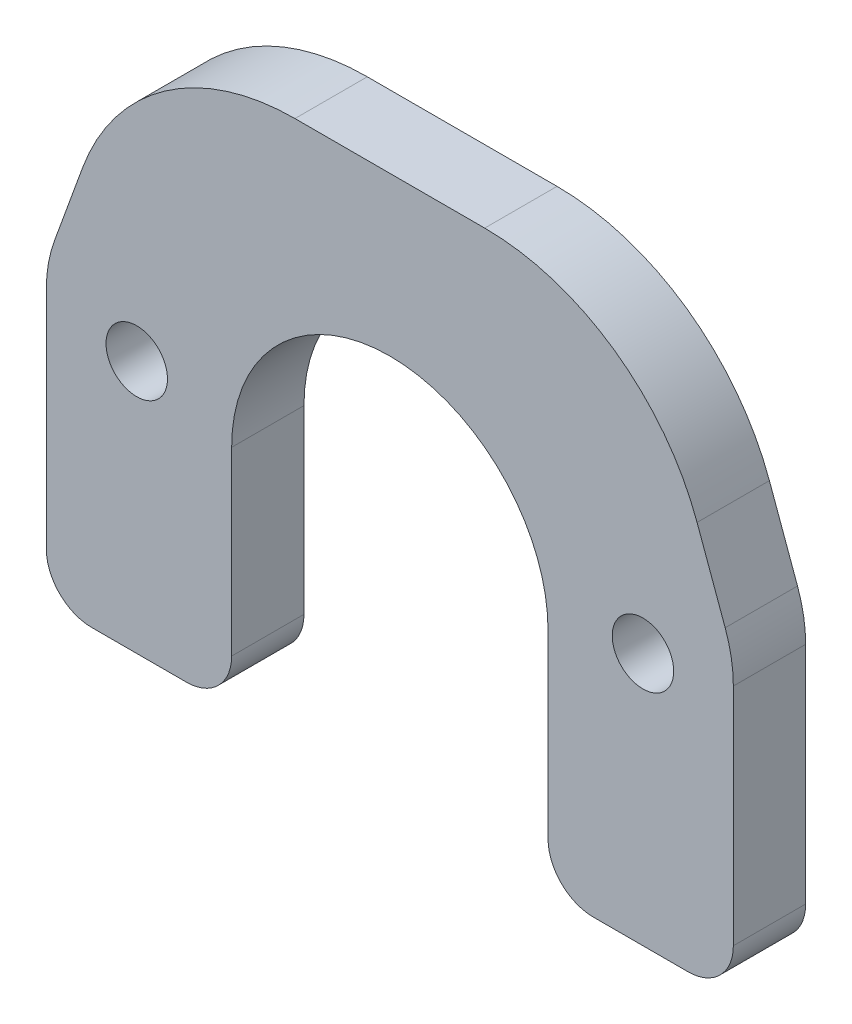
ISO-10303-21;
HEADER;
FILE_DESCRIPTION(('STEP AP214'),'2;1');
FILE_NAME('part.step','',(''),(''),'','','');
FILE_SCHEMA(('AUTOMOTIVE_DESIGN { 1 0 10303 214 1 1 1 1 }'));
ENDSEC;
DATA;
#1=APPLICATION_CONTEXT('core data for automotive mechanical design processes');
#2=APPLICATION_PROTOCOL_DEFINITION('international standard','automotive_design',2000,#1);
#3=PRODUCT_CONTEXT('',#1,'mechanical');
#4=PRODUCT('Part','Part','',(#3));
#5=PRODUCT_RELATED_PRODUCT_CATEGORY('part','',(#4));
#6=PRODUCT_DEFINITION_FORMATION('','',#4);
#7=PRODUCT_DEFINITION_CONTEXT('part definition',#1,'design');
#8=PRODUCT_DEFINITION('design','',#6,#7);
#9=PRODUCT_DEFINITION_SHAPE('','',#8);
#10=(LENGTH_UNIT() NAMED_UNIT(*) SI_UNIT(.MILLI.,.METRE.));
#11=(NAMED_UNIT(*) PLANE_ANGLE_UNIT() SI_UNIT($,.RADIAN.));
#12=(NAMED_UNIT(*) SI_UNIT($,.STERADIAN.) SOLID_ANGLE_UNIT());
#13=UNCERTAINTY_MEASURE_WITH_UNIT(LENGTH_MEASURE(1.E-05),#10,'distance_accuracy_value','');
#14=(GEOMETRIC_REPRESENTATION_CONTEXT(3) GLOBAL_UNCERTAINTY_ASSIGNED_CONTEXT((#13)) GLOBAL_UNIT_ASSIGNED_CONTEXT((#10,
#11,#12)) REPRESENTATION_CONTEXT('',''));
#15=CARTESIAN_POINT('',(0.,0.,0.));
#16=DIRECTION('',(0.,0.,1.));
#17=DIRECTION('',(1.,0.,0.));
#18=AXIS2_PLACEMENT_3D('',#15,#16,#17);
#19=CARTESIAN_POINT('',(0.,-17.5,8.));
#20=DIRECTION('',(0.,0.,-1.));
#21=DIRECTION('',(-1.,0.,0.));
#22=AXIS2_PLACEMENT_3D('',#19,#20,#21);
#23=CYLINDRICAL_SURFACE('',#22,17.5);
#24=CARTESIAN_POINT('',(0.,-17.5,0.));
#25=DIRECTION('',(0.,0.,-1.));
#26=DIRECTION('',(-1.,0.,0.));
#27=AXIS2_PLACEMENT_3D('',#24,#25,#26);
#28=CIRCLE('',#27,17.5);
#29=CARTESIAN_POINT('',(-17.5,-17.5,0.));
#30=VERTEX_POINT('',#29);
#31=CARTESIAN_POINT('',(17.5,-17.5,0.));
#32=VERTEX_POINT('',#31);
#33=EDGE_CURVE('E206',#30,#32,#28,.T.);
#34=ORIENTED_EDGE('',*,*,#33,.T.);
#35=DIRECTION('',(0.,0.,-1.));
#36=VECTOR('',#35,1.);
#37=CARTESIAN_POINT('',(17.5,-17.5,8.));
#38=LINE('',#37,#36);
#39=CARTESIAN_POINT('',(17.5,-17.5,8.));
#40=VERTEX_POINT('',#39);
#41=EDGE_CURVE('E11',#40,#32,#38,.T.);
#42=ORIENTED_EDGE('',*,*,#41,.F.);
#43=CARTESIAN_POINT('',(0.,-17.5,8.));
#44=DIRECTION('',(0.,0.,-1.));
#45=DIRECTION('',(-1.,0.,0.));
#46=AXIS2_PLACEMENT_3D('',#43,#44,#45);
#47=CIRCLE('',#46,17.5);
#48=CARTESIAN_POINT('',(-17.5,-17.5,8.));
#49=VERTEX_POINT('',#48);
#50=EDGE_CURVE('E254',#49,#40,#47,.T.);
#51=ORIENTED_EDGE('',*,*,#50,.F.);
#52=DIRECTION('',(0.,0.,-1.));
#53=VECTOR('',#52,1.);
#54=CARTESIAN_POINT('',(-17.5,-17.5,8.));
#55=LINE('',#54,#53);
#56=EDGE_CURVE('E63',#49,#30,#55,.T.);
#57=ORIENTED_EDGE('',*,*,#56,.T.);
#58=EDGE_LOOP('',(#34,#42,#51,#57));
#59=FACE_BOUND('',#58,.T.);
#60=ADVANCED_FACE('F45',(#59),#23,.F.);
#61=CARTESIAN_POINT('',(17.5,-17.5,8.));
#62=DIRECTION('',(1.,0.,0.));
#63=DIRECTION('',(0.,1.,0.));
#64=AXIS2_PLACEMENT_3D('',#61,#62,#63);
#65=PLANE('',#64);
#66=DIRECTION('',(0.,-1.,0.));
#67=VECTOR('',#66,1.);
#68=CARTESIAN_POINT('',(17.5,-17.5,0.));
#69=LINE('',#68,#67);
#70=CARTESIAN_POINT('',(17.5,-37.5,0.));
#71=VERTEX_POINT('',#70);
#72=EDGE_CURVE('E208',#32,#71,#69,.T.);
#73=ORIENTED_EDGE('',*,*,#72,.T.);
#74=DIRECTION('',(0.,0.,-1.));
#75=VECTOR('',#74,1.);
#76=CARTESIAN_POINT('',(17.5,-37.5,8.));
#77=LINE('',#76,#75);
#78=CARTESIAN_POINT('',(17.5,-37.5,8.));
#79=VERTEX_POINT('',#78);
#80=EDGE_CURVE('E54',#79,#71,#77,.T.);
#81=ORIENTED_EDGE('',*,*,#80,.F.);
#82=DIRECTION('',(0.,-1.,0.));
#83=VECTOR('',#82,1.);
#84=CARTESIAN_POINT('',(17.5,-17.5,8.));
#85=LINE('',#84,#83);
#86=EDGE_CURVE('E132',#40,#79,#85,.T.);
#87=ORIENTED_EDGE('',*,*,#86,.F.);
#88=ORIENTED_EDGE('',*,*,#41,.T.);
#89=EDGE_LOOP('',(#73,#81,#87,#88));
#90=FACE_BOUND('',#89,.T.);
#91=ADVANCED_FACE('F349',(#90),#65,.F.);
#92=CARTESIAN_POINT('',(22.5,-37.5,8.));
#93=DIRECTION('',(0.,0.,-1.));
#94=DIRECTION('',(-1.,0.,0.));
#95=AXIS2_PLACEMENT_3D('',#92,#93,#94);
#96=CYLINDRICAL_SURFACE('',#95,4.99999999999999);
#97=CARTESIAN_POINT('',(22.5,-37.5,0.));
#98=DIRECTION('',(0.,0.,1.));
#99=DIRECTION('',(1.,0.,0.));
#100=AXIS2_PLACEMENT_3D('',#97,#98,#99);
#101=CIRCLE('',#100,4.99999999999999);
#102=CARTESIAN_POINT('',(22.5,-42.5,0.));
#103=VERTEX_POINT('',#102);
#104=EDGE_CURVE('E211',#71,#103,#101,.T.);
#105=ORIENTED_EDGE('',*,*,#104,.T.);
#106=DIRECTION('',(0.,0.,-1.));
#107=VECTOR('',#106,1.);
#108=CARTESIAN_POINT('',(22.5,-42.5,8.));
#109=LINE('',#108,#107);
#110=CARTESIAN_POINT('',(22.5,-42.5,8.));
#111=VERTEX_POINT('',#110);
#112=EDGE_CURVE('E281',#111,#103,#109,.T.);
#113=ORIENTED_EDGE('',*,*,#112,.F.);
#114=CARTESIAN_POINT('',(22.5,-37.5,8.));
#115=DIRECTION('',(0.,0.,1.));
#116=DIRECTION('',(1.,0.,0.));
#117=AXIS2_PLACEMENT_3D('',#114,#115,#116);
#118=CIRCLE('',#117,4.99999999999999);
#119=EDGE_CURVE('E299',#79,#111,#118,.T.);
#120=ORIENTED_EDGE('',*,*,#119,.F.);
#121=ORIENTED_EDGE('',*,*,#80,.T.);
#122=EDGE_LOOP('',(#105,#113,#120,#121));
#123=FACE_BOUND('',#122,.T.);
#124=ADVANCED_FACE('F353',(#123),#96,.T.);
#125=CARTESIAN_POINT('',(22.5,-42.5,8.));
#126=DIRECTION('',(0.,1.,0.));
#127=DIRECTION('',(0.,0.,1.));
#128=AXIS2_PLACEMENT_3D('',#125,#126,#127);
#129=PLANE('',#128);
#130=DIRECTION('',(1.,0.,0.));
#131=VECTOR('',#130,1.);
#132=CARTESIAN_POINT('',(22.5,-42.5,0.));
#133=LINE('',#132,#131);
#134=CARTESIAN_POINT('',(33.,-42.5,0.));
#135=VERTEX_POINT('',#134);
#136=EDGE_CURVE('E213',#103,#135,#133,.T.);
#137=ORIENTED_EDGE('',*,*,#136,.T.);
#138=DIRECTION('',(0.,0.,-1.));
#139=VECTOR('',#138,1.);
#140=CARTESIAN_POINT('',(33.,-42.5,8.));
#141=LINE('',#140,#139);
#142=CARTESIAN_POINT('',(33.,-42.5,8.));
#143=VERTEX_POINT('',#142);
#144=EDGE_CURVE('E279',#143,#135,#141,.T.);
#145=ORIENTED_EDGE('',*,*,#144,.F.);
#146=DIRECTION('',(1.,0.,0.));
#147=VECTOR('',#146,1.);
#148=CARTESIAN_POINT('',(22.5,-42.5,8.));
#149=LINE('',#148,#147);
#150=EDGE_CURVE('E301',#111,#143,#149,.T.);
#151=ORIENTED_EDGE('',*,*,#150,.F.);
#152=ORIENTED_EDGE('',*,*,#112,.T.);
#153=EDGE_LOOP('',(#137,#145,#151,#152));
#154=FACE_BOUND('',#153,.T.);
#155=ADVANCED_FACE('F494',(#154),#129,.F.);
#156=CARTESIAN_POINT('',(33.,-37.5,8.));
#157=DIRECTION('',(0.,0.,-1.));
#158=DIRECTION('',(-1.,0.,0.));
#159=AXIS2_PLACEMENT_3D('',#156,#157,#158);
#160=CYLINDRICAL_SURFACE('',#159,4.99999999999999);
#161=CARTESIAN_POINT('',(33.,-37.5,0.));
#162=DIRECTION('',(0.,0.,-1.));
#163=DIRECTION('',(-1.,0.,0.));
#164=AXIS2_PLACEMENT_3D('',#161,#162,#163);
#165=CIRCLE('',#164,4.99999999999999);
#166=CARTESIAN_POINT('',(38.,-37.5,0.));
#167=VERTEX_POINT('',#166);
#168=EDGE_CURVE('E216',#167,#135,#165,.T.);
#169=ORIENTED_EDGE('',*,*,#168,.F.);
#170=DIRECTION('',(0.,0.,-1.));
#171=VECTOR('',#170,1.);
#172=CARTESIAN_POINT('',(38.,-37.5,8.));
#173=LINE('',#172,#171);
#174=CARTESIAN_POINT('',(38.,-37.5,8.));
#175=VERTEX_POINT('',#174);
#176=EDGE_CURVE('E277',#175,#167,#173,.T.);
#177=ORIENTED_EDGE('',*,*,#176,.F.);
#178=CARTESIAN_POINT('',(33.,-37.5,8.));
#179=DIRECTION('',(0.,0.,-1.));
#180=DIRECTION('',(-1.,0.,0.));
#181=AXIS2_PLACEMENT_3D('',#178,#179,#180);
#182=CIRCLE('',#181,4.99999999999999);
#183=EDGE_CURVE('E303',#175,#143,#182,.T.);
#184=ORIENTED_EDGE('',*,*,#183,.T.);
#185=ORIENTED_EDGE('',*,*,#144,.T.);
#186=EDGE_LOOP('',(#169,#177,#184,#185));
#187=FACE_BOUND('',#186,.T.);
#188=ADVANCED_FACE('F486',(#187),#160,.T.);
#189=CARTESIAN_POINT('',(38.,-37.5,8.));
#190=DIRECTION('',(-1.,0.,0.));
#191=DIRECTION('',(0.,0.,1.));
#192=AXIS2_PLACEMENT_3D('',#189,#190,#191);
#193=PLANE('',#192);
#194=DIRECTION('',(0.,1.,0.));
#195=VECTOR('',#194,1.);
#196=CARTESIAN_POINT('',(38.,-37.5,0.));
#197=LINE('',#196,#195);
#198=CARTESIAN_POINT('',(38.,-12.6196789051737,0.));
#199=VERTEX_POINT('',#198);
#200=EDGE_CURVE('E219',#167,#199,#197,.T.);
#201=ORIENTED_EDGE('',*,*,#200,.T.);
#202=DIRECTION('',(0.,0.,-1.));
#203=VECTOR('',#202,1.);
#204=CARTESIAN_POINT('',(38.,-12.6196789051737,8.));
#205=LINE('',#204,#203);
#206=CARTESIAN_POINT('',(38.,-12.6196789051737,8.));
#207=VERTEX_POINT('',#206);
#208=EDGE_CURVE('E275',#207,#199,#205,.T.);
#209=ORIENTED_EDGE('',*,*,#208,.F.);
#210=DIRECTION('',(0.,1.,0.));
#211=VECTOR('',#210,1.);
#212=CARTESIAN_POINT('',(38.,-37.5,8.));
#213=LINE('',#212,#211);
#214=EDGE_CURVE('E306',#175,#207,#213,.T.);
#215=ORIENTED_EDGE('',*,*,#214,.F.);
#216=ORIENTED_EDGE('',*,*,#176,.T.);
#217=EDGE_LOOP('',(#201,#209,#215,#216));
#218=FACE_BOUND('',#217,.T.);
#219=ADVANCED_FACE('F478',(#218),#193,.F.);
#220=CARTESIAN_POINT('',(23.,-12.6196789051737,8.));
#221=DIRECTION('',(0.,0.,-1.));
#222=DIRECTION('',(-1.,0.,0.));
#223=AXIS2_PLACEMENT_3D('',#220,#221,#222);
#224=CYLINDRICAL_SURFACE('',#223,15.);
#225=CARTESIAN_POINT('',(23.,-12.6196789051737,0.));
#226=DIRECTION('',(0.,0.,-1.));
#227=DIRECTION('',(-1.,0.,0.));
#228=AXIS2_PLACEMENT_3D('',#225,#226,#227);
#229=CIRCLE('',#228,15.);
#230=CARTESIAN_POINT('',(37.0953893117887,-7.48937675528878,0.));
#231=VERTEX_POINT('',#230);
#232=EDGE_CURVE('E222',#231,#199,#229,.T.);
#233=ORIENTED_EDGE('',*,*,#232,.F.);
#234=DIRECTION('',(0.,0.,-1.));
#235=VECTOR('',#234,1.);
#236=CARTESIAN_POINT('',(37.0953893117887,-7.48937675528878,8.));
#237=LINE('',#236,#235);
#238=CARTESIAN_POINT('',(37.0953893117887,-7.48937675528878,8.));
#239=VERTEX_POINT('',#238);
#240=EDGE_CURVE('E273',#239,#231,#237,.T.);
#241=ORIENTED_EDGE('',*,*,#240,.F.);
#242=CARTESIAN_POINT('',(23.,-12.6196789051737,8.));
#243=DIRECTION('',(0.,0.,-1.));
#244=DIRECTION('',(-1.,0.,0.));
#245=AXIS2_PLACEMENT_3D('',#242,#243,#244);
#246=CIRCLE('',#245,15.);
#247=EDGE_CURVE('E308',#239,#207,#246,.T.);
#248=ORIENTED_EDGE('',*,*,#247,.T.);
#249=ORIENTED_EDGE('',*,*,#208,.T.);
#250=EDGE_LOOP('',(#233,#241,#248,#249));
#251=FACE_BOUND('',#250,.T.);
#252=ADVANCED_FACE('F470',(#251),#224,.T.);
#253=CARTESIAN_POINT('',(37.0953893117887,-7.48937675528878,8.));
#254=DIRECTION('',(-0.93969262078591,-0.342020143325666,0.));
#255=DIRECTION('',(0.342020143325666,-0.93969262078591,0.));
#256=AXIS2_PLACEMENT_3D('',#253,#254,#255);
#257=PLANE('',#256);
#258=DIRECTION('',(-0.342020143325666,0.93969262078591,0.));
#259=VECTOR('',#258,1.);
#260=CARTESIAN_POINT('',(37.0953893117887,-7.48937675528878,0.));
#261=LINE('',#260,#259);
#262=CARTESIAN_POINT('',(33.9871270644049,1.05050358314156,0.));
#263=VERTEX_POINT('',#262);
#264=EDGE_CURVE('E225',#231,#263,#261,.T.);
#265=ORIENTED_EDGE('',*,*,#264,.T.);
#266=DIRECTION('',(0.,0.,-1.));
#267=VECTOR('',#266,1.);
#268=CARTESIAN_POINT('',(33.9871270644049,1.05050358314156,8.));
#269=LINE('',#268,#267);
#270=CARTESIAN_POINT('',(33.9871270644049,1.05050358314156,8.));
#271=VERTEX_POINT('',#270);
#272=EDGE_CURVE('E271',#271,#263,#269,.T.);
#273=ORIENTED_EDGE('',*,*,#272,.F.);
#274=DIRECTION('',(-0.342020143325666,0.93969262078591,0.));
#275=VECTOR('',#274,1.);
#276=CARTESIAN_POINT('',(37.0953893117887,-7.48937675528878,8.));
#277=LINE('',#276,#275);
#278=EDGE_CURVE('E311',#239,#271,#277,.T.);
#279=ORIENTED_EDGE('',*,*,#278,.F.);
#280=ORIENTED_EDGE('',*,*,#240,.T.);
#281=EDGE_LOOP('',(#265,#273,#279,#280));
#282=FACE_BOUND('',#281,.T.);
#283=ADVANCED_FACE('F462',(#282),#257,.F.);
#284=CARTESIAN_POINT('',(10.4948115447571,-7.50000000000001,8.));
#285=DIRECTION('',(0.,0.,-1.));
#286=DIRECTION('',(-1.,0.,0.));
#287=AXIS2_PLACEMENT_3D('',#284,#285,#286);
#288=CYLINDRICAL_SURFACE('',#287,25.);
#289=CARTESIAN_POINT('',(10.4948115447571,-7.50000000000001,0.));
#290=DIRECTION('',(0.,0.,-1.));
#291=DIRECTION('',(-1.,0.,0.));
#292=AXIS2_PLACEMENT_3D('',#289,#290,#291);
#293=CIRCLE('',#292,25.);
#294=CARTESIAN_POINT('',(10.4948115447571,17.5,0.));
#295=VERTEX_POINT('',#294);
#296=EDGE_CURVE('E228',#295,#263,#293,.T.);
#297=ORIENTED_EDGE('',*,*,#296,.F.);
#298=DIRECTION('',(0.,0.,-1.));
#299=VECTOR('',#298,1.);
#300=CARTESIAN_POINT('',(10.4948115447571,17.5,8.));
#301=LINE('',#300,#299);
#302=CARTESIAN_POINT('',(10.4948115447571,17.5,8.));
#303=VERTEX_POINT('',#302);
#304=EDGE_CURVE('E269',#303,#295,#301,.T.);
#305=ORIENTED_EDGE('',*,*,#304,.F.);
#306=CARTESIAN_POINT('',(10.4948115447571,-7.50000000000001,8.));
#307=DIRECTION('',(0.,0.,-1.));
#308=DIRECTION('',(-1.,0.,0.));
#309=AXIS2_PLACEMENT_3D('',#306,#307,#308);
#310=CIRCLE('',#309,25.);
#311=EDGE_CURVE('E313',#303,#271,#310,.T.);
#312=ORIENTED_EDGE('',*,*,#311,.T.);
#313=ORIENTED_EDGE('',*,*,#272,.T.);
#314=EDGE_LOOP('',(#297,#305,#312,#313));
#315=FACE_BOUND('',#314,.T.);
#316=ADVANCED_FACE('F454',(#315),#288,.T.);
#317=CARTESIAN_POINT('',(10.4948115447571,17.5,8.));
#318=DIRECTION('',(0.,-1.,0.));
#319=DIRECTION('',(1.,0.,0.));
#320=AXIS2_PLACEMENT_3D('',#317,#318,#319);
#321=PLANE('',#320);
#322=DIRECTION('',(-1.,0.,0.));
#323=VECTOR('',#322,1.);
#324=CARTESIAN_POINT('',(10.4948115447571,17.5,0.));
#325=LINE('',#324,#323);
#326=CARTESIAN_POINT('',(-10.4948115447571,17.5,0.));
#327=VERTEX_POINT('',#326);
#328=EDGE_CURVE('E231',#295,#327,#325,.T.);
#329=ORIENTED_EDGE('',*,*,#328,.T.);
#330=DIRECTION('',(0.,0.,-1.));
#331=VECTOR('',#330,1.);
#332=CARTESIAN_POINT('',(-10.4948115447571,17.5,8.));
#333=LINE('',#332,#331);
#334=CARTESIAN_POINT('',(-10.4948115447571,17.5,8.));
#335=VERTEX_POINT('',#334);
#336=EDGE_CURVE('E266',#335,#327,#333,.T.);
#337=ORIENTED_EDGE('',*,*,#336,.F.);
#338=DIRECTION('',(-1.,0.,0.));
#339=VECTOR('',#338,1.);
#340=CARTESIAN_POINT('',(10.4948115447571,17.5,8.));
#341=LINE('',#340,#339);
#342=EDGE_CURVE('E316',#303,#335,#341,.T.);
#343=ORIENTED_EDGE('',*,*,#342,.F.);
#344=ORIENTED_EDGE('',*,*,#304,.T.);
#345=EDGE_LOOP('',(#329,#337,#343,#344));
#346=FACE_BOUND('',#345,.T.);
#347=ADVANCED_FACE('F446',(#346),#321,.F.);
#348=CARTESIAN_POINT('',(-10.4948115447571,-7.50000000000001,8.));
#349=DIRECTION('',(0.,0.,-1.));
#350=DIRECTION('',(-1.,0.,0.));
#351=AXIS2_PLACEMENT_3D('',#348,#349,#350);
#352=CYLINDRICAL_SURFACE('',#351,25.);
#353=CARTESIAN_POINT('',(-10.4948115447571,-7.50000000000001,0.));
#354=DIRECTION('',(0.,0.,1.));
#355=DIRECTION('',(1.,0.,0.));
#356=AXIS2_PLACEMENT_3D('',#353,#354,#355);
#357=CIRCLE('',#356,25.);
#358=CARTESIAN_POINT('',(-33.9871270644049,1.05050358314155,0.));
#359=VERTEX_POINT('',#358);
#360=EDGE_CURVE('E233',#327,#359,#357,.T.);
#361=ORIENTED_EDGE('',*,*,#360,.T.);
#362=DIRECTION('',(0.,0.,-1.));
#363=VECTOR('',#362,1.);
#364=CARTESIAN_POINT('',(-33.9871270644049,1.05050358314155,8.));
#365=LINE('',#364,#363);
#366=CARTESIAN_POINT('',(-33.9871270644049,1.05050358314155,8.));
#367=VERTEX_POINT('',#366);
#368=EDGE_CURVE('E264',#367,#359,#365,.T.);
#369=ORIENTED_EDGE('',*,*,#368,.F.);
#370=CARTESIAN_POINT('',(-10.4948115447571,-7.50000000000001,8.));
#371=DIRECTION('',(0.,0.,1.));
#372=DIRECTION('',(1.,0.,0.));
#373=AXIS2_PLACEMENT_3D('',#370,#371,#372);
#374=CIRCLE('',#373,25.);
#375=EDGE_CURVE('E318',#335,#367,#374,.T.);
#376=ORIENTED_EDGE('',*,*,#375,.F.);
#377=ORIENTED_EDGE('',*,*,#336,.T.);
#378=EDGE_LOOP('',(#361,#369,#376,#377));
#379=FACE_BOUND('',#378,.T.);
#380=ADVANCED_FACE('F438',(#379),#352,.T.);
#381=CARTESIAN_POINT('',(-37.0953893117887,-7.48937675528878,8.));
#382=DIRECTION('',(-0.939692620785909,0.342020143325667,0.));
#383=DIRECTION('',(-0.342020143325667,-0.939692620785909,0.));
#384=AXIS2_PLACEMENT_3D('',#381,#382,#383);
#385=PLANE('',#384);
#386=DIRECTION('',(0.342020143325667,0.939692620785909,0.));
#387=VECTOR('',#386,1.);
#388=CARTESIAN_POINT('',(-37.0953893117887,-7.48937675528878,0.));
#389=LINE('',#388,#387);
#390=CARTESIAN_POINT('',(-37.0953893117887,-7.48937675528878,0.));
#391=VERTEX_POINT('',#390);
#392=EDGE_CURVE('E236',#391,#359,#389,.T.);
#393=ORIENTED_EDGE('',*,*,#392,.F.);
#394=DIRECTION('',(0.,0.,-1.));
#395=VECTOR('',#394,1.);
#396=CARTESIAN_POINT('',(-37.0953893117887,-7.48937675528878,8.));
#397=LINE('',#396,#395);
#398=CARTESIAN_POINT('',(-37.0953893117887,-7.48937675528878,8.));
#399=VERTEX_POINT('',#398);
#400=EDGE_CURVE('E262',#399,#391,#397,.T.);
#401=ORIENTED_EDGE('',*,*,#400,.F.);
#402=DIRECTION('',(0.342020143325667,0.939692620785909,0.));
#403=VECTOR('',#402,1.);
#404=CARTESIAN_POINT('',(-37.0953893117887,-7.48937675528878,8.));
#405=LINE('',#404,#403);
#406=EDGE_CURVE('E320',#399,#367,#405,.T.);
#407=ORIENTED_EDGE('',*,*,#406,.T.);
#408=ORIENTED_EDGE('',*,*,#368,.T.);
#409=EDGE_LOOP('',(#393,#401,#407,#408));
#410=FACE_BOUND('',#409,.T.);
#411=ADVANCED_FACE('F431',(#410),#385,.T.);
#412=CARTESIAN_POINT('',(-23.,-12.6196789051737,8.));
#413=DIRECTION('',(0.,0.,-1.));
#414=DIRECTION('',(-1.,0.,0.));
#415=AXIS2_PLACEMENT_3D('',#412,#413,#414);
#416=CYLINDRICAL_SURFACE('',#415,15.);
#417=CARTESIAN_POINT('',(-23.,-12.6196789051737,0.));
#418=DIRECTION('',(0.,0.,1.));
#419=DIRECTION('',(1.,0.,0.));
#420=AXIS2_PLACEMENT_3D('',#417,#418,#419);
#421=CIRCLE('',#420,15.);
#422=CARTESIAN_POINT('',(-38.,-12.6196789051737,0.));
#423=VERTEX_POINT('',#422);
#424=EDGE_CURVE('E239',#391,#423,#421,.T.);
#425=ORIENTED_EDGE('',*,*,#424,.T.);
#426=DIRECTION('',(0.,0.,-1.));
#427=VECTOR('',#426,1.);
#428=CARTESIAN_POINT('',(-38.,-12.6196789051737,8.));
#429=LINE('',#428,#427);
#430=CARTESIAN_POINT('',(-38.,-12.6196789051737,8.));
#431=VERTEX_POINT('',#430);
#432=EDGE_CURVE('E260',#431,#423,#429,.T.);
#433=ORIENTED_EDGE('',*,*,#432,.F.);
#434=CARTESIAN_POINT('',(-23.,-12.6196789051737,8.));
#435=DIRECTION('',(0.,0.,1.));
#436=DIRECTION('',(1.,0.,0.));
#437=AXIS2_PLACEMENT_3D('',#434,#435,#436);
#438=CIRCLE('',#437,15.);
#439=EDGE_CURVE('E323',#399,#431,#438,.T.);
#440=ORIENTED_EDGE('',*,*,#439,.F.);
#441=ORIENTED_EDGE('',*,*,#400,.T.);
#442=EDGE_LOOP('',(#425,#433,#440,#441));
#443=FACE_BOUND('',#442,.T.);
#444=ADVANCED_FACE('F332',(#443),#416,.T.);
#445=CARTESIAN_POINT('',(-38.,-37.5,8.));
#446=DIRECTION('',(-1.,0.,0.));
#447=DIRECTION('',(0.,-1.,0.));
#448=AXIS2_PLACEMENT_3D('',#445,#446,#447);
#449=PLANE('',#448);
#450=DIRECTION('',(0.,1.,0.));
#451=VECTOR('',#450,1.);
#452=CARTESIAN_POINT('',(-38.,-37.5,0.));
#453=LINE('',#452,#451);
#454=CARTESIAN_POINT('',(-38.,-37.5,0.));
#455=VERTEX_POINT('',#454);
#456=EDGE_CURVE('E242',#455,#423,#453,.T.);
#457=ORIENTED_EDGE('',*,*,#456,.F.);
#458=DIRECTION('',(0.,0.,-1.));
#459=VECTOR('',#458,1.);
#460=CARTESIAN_POINT('',(-38.,-37.5,8.));
#461=LINE('',#460,#459);
#462=CARTESIAN_POINT('',(-38.,-37.5,8.));
#463=VERTEX_POINT('',#462);
#464=EDGE_CURVE('E258',#463,#455,#461,.T.);
#465=ORIENTED_EDGE('',*,*,#464,.F.);
#466=DIRECTION('',(0.,1.,0.));
#467=VECTOR('',#466,1.);
#468=CARTESIAN_POINT('',(-38.,-37.5,8.));
#469=LINE('',#468,#467);
#470=EDGE_CURVE('E201',#463,#431,#469,.T.);
#471=ORIENTED_EDGE('',*,*,#470,.T.);
#472=ORIENTED_EDGE('',*,*,#432,.T.);
#473=EDGE_LOOP('',(#457,#465,#471,#472));
#474=FACE_BOUND('',#473,.T.);
#475=ADVANCED_FACE('F327',(#474),#449,.T.);
#476=CARTESIAN_POINT('',(-33.,-37.5,8.));
#477=DIRECTION('',(0.,0.,-1.));
#478=DIRECTION('',(-1.,0.,0.));
#479=AXIS2_PLACEMENT_3D('',#476,#477,#478);
#480=CYLINDRICAL_SURFACE('',#479,4.99999999999999);
#481=CARTESIAN_POINT('',(-33.,-37.5,0.));
#482=DIRECTION('',(0.,0.,1.));
#483=DIRECTION('',(1.,0.,0.));
#484=AXIS2_PLACEMENT_3D('',#481,#482,#483);
#485=CIRCLE('',#484,4.99999999999999);
#486=CARTESIAN_POINT('',(-33.,-42.5,0.));
#487=VERTEX_POINT('',#486);
#488=EDGE_CURVE('E245',#455,#487,#485,.T.);
#489=ORIENTED_EDGE('',*,*,#488,.T.);
#490=DIRECTION('',(0.,0.,-1.));
#491=VECTOR('',#490,1.);
#492=CARTESIAN_POINT('',(-33.,-42.5,8.));
#493=LINE('',#492,#491);
#494=CARTESIAN_POINT('',(-33.,-42.5,8.));
#495=VERTEX_POINT('',#494);
#496=EDGE_CURVE('E187',#495,#487,#493,.T.);
#497=ORIENTED_EDGE('',*,*,#496,.F.);
#498=CARTESIAN_POINT('',(-33.,-37.5,8.));
#499=DIRECTION('',(0.,0.,1.));
#500=DIRECTION('',(1.,0.,0.));
#501=AXIS2_PLACEMENT_3D('',#498,#499,#500);
#502=CIRCLE('',#501,4.99999999999999);
#503=EDGE_CURVE('E198',#463,#495,#502,.T.);
#504=ORIENTED_EDGE('',*,*,#503,.F.);
#505=ORIENTED_EDGE('',*,*,#464,.T.);
#506=EDGE_LOOP('',(#489,#497,#504,#505));
#507=FACE_BOUND('',#506,.T.);
#508=ADVANCED_FACE('F339',(#507),#480,.T.);
#509=CARTESIAN_POINT('',(-22.5,-42.5,8.));
#510=DIRECTION('',(0.,-1.,0.));
#511=DIRECTION('',(0.,0.,-1.));
#512=AXIS2_PLACEMENT_3D('',#509,#510,#511);
#513=PLANE('',#512);
#514=DIRECTION('',(-1.,0.,0.));
#515=VECTOR('',#514,1.);
#516=CARTESIAN_POINT('',(-22.5,-42.5,0.));
#517=LINE('',#516,#515);
#518=CARTESIAN_POINT('',(-22.5,-42.5,0.));
#519=VERTEX_POINT('',#518);
#520=EDGE_CURVE('E184',#519,#487,#517,.T.);
#521=ORIENTED_EDGE('',*,*,#520,.F.);
#522=DIRECTION('',(0.,0.,-1.));
#523=VECTOR('',#522,1.);
#524=CARTESIAN_POINT('',(-22.5,-42.5,8.));
#525=LINE('',#524,#523);
#526=CARTESIAN_POINT('',(-22.5,-42.5,8.));
#527=VERTEX_POINT('',#526);
#528=EDGE_CURVE('E178',#527,#519,#525,.T.);
#529=ORIENTED_EDGE('',*,*,#528,.F.);
#530=DIRECTION('',(-1.,0.,0.));
#531=VECTOR('',#530,1.);
#532=CARTESIAN_POINT('',(-22.5,-42.5,8.));
#533=LINE('',#532,#531);
#534=EDGE_CURVE('E182',#527,#495,#533,.T.);
#535=ORIENTED_EDGE('',*,*,#534,.T.);
#536=ORIENTED_EDGE('',*,*,#496,.T.);
#537=EDGE_LOOP('',(#521,#529,#535,#536));
#538=FACE_BOUND('',#537,.T.);
#539=ADVANCED_FACE('F180',(#538),#513,.T.);
#540=CARTESIAN_POINT('',(-22.5,-37.5,8.));
#541=DIRECTION('',(0.,0.,-1.));
#542=DIRECTION('',(-1.,0.,0.));
#543=AXIS2_PLACEMENT_3D('',#540,#541,#542);
#544=CYLINDRICAL_SURFACE('',#543,4.99999999999999);
#545=CARTESIAN_POINT('',(-22.5,-37.5,0.));
#546=DIRECTION('',(0.,0.,1.));
#547=DIRECTION('',(1.,0.,0.));
#548=AXIS2_PLACEMENT_3D('',#545,#546,#547);
#549=CIRCLE('',#548,4.99999999999999);
#550=CARTESIAN_POINT('',(-17.5,-37.5,0.));
#551=VERTEX_POINT('',#550);
#552=EDGE_CURVE('E249',#519,#551,#549,.T.);
#553=ORIENTED_EDGE('',*,*,#552,.T.);
#554=DIRECTION('',(0.,0.,-1.));
#555=VECTOR('',#554,1.);
#556=CARTESIAN_POINT('',(-17.5,-37.5,8.));
#557=LINE('',#556,#555);
#558=CARTESIAN_POINT('',(-17.5,-37.5,8.));
#559=VERTEX_POINT('',#558);
#560=EDGE_CURVE('E120',#559,#551,#557,.T.);
#561=ORIENTED_EDGE('',*,*,#560,.F.);
#562=CARTESIAN_POINT('',(-22.5,-37.5,8.));
#563=DIRECTION('',(0.,0.,1.));
#564=DIRECTION('',(1.,0.,0.));
#565=AXIS2_PLACEMENT_3D('',#562,#563,#564);
#566=CIRCLE('',#565,4.99999999999999);
#567=EDGE_CURVE('E189',#527,#559,#566,.T.);
#568=ORIENTED_EDGE('',*,*,#567,.F.);
#569=ORIENTED_EDGE('',*,*,#528,.T.);
#570=EDGE_LOOP('',(#553,#561,#568,#569));
#571=FACE_BOUND('',#570,.T.);
#572=ADVANCED_FACE('F190',(#571),#544,.T.);
#573=CARTESIAN_POINT('',(-17.5,-17.5,8.));
#574=DIRECTION('',(1.,0.,0.));
#575=DIRECTION('',(0.,1.,0.));
#576=AXIS2_PLACEMENT_3D('',#573,#574,#575);
#577=PLANE('',#576);
#578=DIRECTION('',(0.,-1.,0.));
#579=VECTOR('',#578,1.);
#580=CARTESIAN_POINT('',(-17.5,-17.5,0.));
#581=LINE('',#580,#579);
#582=EDGE_CURVE('E251',#30,#551,#581,.T.);
#583=ORIENTED_EDGE('',*,*,#582,.F.);
#584=ORIENTED_EDGE('',*,*,#56,.F.);
#585=DIRECTION('',(0.,-1.,0.));
#586=VECTOR('',#585,1.);
#587=CARTESIAN_POINT('',(-17.5,-17.5,8.));
#588=LINE('',#587,#586);
#589=EDGE_CURVE('E193',#49,#559,#588,.T.);
#590=ORIENTED_EDGE('',*,*,#589,.T.);
#591=ORIENTED_EDGE('',*,*,#560,.T.);
#592=EDGE_LOOP('',(#583,#584,#590,#591));
#593=FACE_BOUND('',#592,.T.);
#594=ADVANCED_FACE('F356',(#593),#577,.T.);
#595=CARTESIAN_POINT('',(0.,-17.5,8.));
#596=DIRECTION('',(0.,0.,-1.));
#597=DIRECTION('',(-1.,0.,0.));
#598=AXIS2_PLACEMENT_3D('',#595,#596,#597);
#599=PLANE('',#598);
#600=CARTESIAN_POINT('',(28.,-14.5,8.));
#601=DIRECTION('',(0.,0.,1.));
#602=DIRECTION('',(1.,0.,0.));
#603=AXIS2_PLACEMENT_3D('',#600,#601,#602);
#604=CIRCLE('',#603,3.4);
#605=CARTESIAN_POINT('',(31.4,-14.5,8.));
#606=VERTEX_POINT('',#605);
#607=EDGE_CURVE('E294',#606,#606,#604,.T.);
#608=ORIENTED_EDGE('',*,*,#607,.F.);
#609=EDGE_LOOP('',(#608));
#610=FACE_BOUND('',#609,.T.);
#611=CARTESIAN_POINT('',(-28.,-14.5,8.));
#612=DIRECTION('',(0.,0.,1.));
#613=DIRECTION('',(1.,0.,0.));
#614=AXIS2_PLACEMENT_3D('',#611,#612,#613);
#615=CIRCLE('',#614,3.4);
#616=CARTESIAN_POINT('',(-24.6,-14.5,8.));
#617=VERTEX_POINT('',#616);
#618=EDGE_CURVE('E286',#617,#617,#615,.T.);
#619=ORIENTED_EDGE('',*,*,#618,.F.);
#620=EDGE_LOOP('',(#619));
#621=FACE_BOUND('',#620,.T.);
#622=ORIENTED_EDGE('',*,*,#50,.T.);
#623=ORIENTED_EDGE('',*,*,#86,.T.);
#624=ORIENTED_EDGE('',*,*,#119,.T.);
#625=ORIENTED_EDGE('',*,*,#150,.T.);
#626=ORIENTED_EDGE('',*,*,#183,.F.);
#627=ORIENTED_EDGE('',*,*,#214,.T.);
#628=ORIENTED_EDGE('',*,*,#247,.F.);
#629=ORIENTED_EDGE('',*,*,#278,.T.);
#630=ORIENTED_EDGE('',*,*,#311,.F.);
#631=ORIENTED_EDGE('',*,*,#342,.T.);
#632=ORIENTED_EDGE('',*,*,#375,.T.);
#633=ORIENTED_EDGE('',*,*,#406,.F.);
#634=ORIENTED_EDGE('',*,*,#439,.T.);
#635=ORIENTED_EDGE('',*,*,#470,.F.);
#636=ORIENTED_EDGE('',*,*,#503,.T.);
#637=ORIENTED_EDGE('',*,*,#534,.F.);
#638=ORIENTED_EDGE('',*,*,#567,.T.);
#639=ORIENTED_EDGE('',*,*,#589,.F.);
#640=EDGE_LOOP('',(#622,#623,#624,#625,#626,#627,#628,#629,#630,#631,#632,#633,#634,#635,#636,
#637,#638,#639));
#641=FACE_BOUND('',#640,.T.);
#642=ADVANCED_FACE('F195',(#610,#621,#641),#599,.F.);
#643=CARTESIAN_POINT('',(0.,-17.5,0.));
#644=DIRECTION('',(0.,0.,-1.));
#645=DIRECTION('',(-1.,0.,0.));
#646=AXIS2_PLACEMENT_3D('',#643,#644,#645);
#647=PLANE('',#646);
#648=CARTESIAN_POINT('',(28.,-14.5,0.));
#649=DIRECTION('',(0.,0.,-1.));
#650=DIRECTION('',(-1.,0.,0.));
#651=AXIS2_PLACEMENT_3D('',#648,#649,#650);
#652=CIRCLE('',#651,3.4);
#653=CARTESIAN_POINT('',(24.6,-14.5,0.));
#654=VERTEX_POINT('',#653);
#655=EDGE_CURVE('E48',#654,#654,#652,.T.);
#656=ORIENTED_EDGE('',*,*,#655,.F.);
#657=EDGE_LOOP('',(#656));
#658=FACE_BOUND('',#657,.T.);
#659=CARTESIAN_POINT('',(-28.,-14.5,0.));
#660=DIRECTION('',(0.,0.,-1.));
#661=DIRECTION('',(-1.,0.,0.));
#662=AXIS2_PLACEMENT_3D('',#659,#660,#661);
#663=CIRCLE('',#662,3.4);
#664=CARTESIAN_POINT('',(-31.4,-14.5,0.));
#665=VERTEX_POINT('',#664);
#666=EDGE_CURVE('E209',#665,#665,#663,.T.);
#667=ORIENTED_EDGE('',*,*,#666,.F.);
#668=EDGE_LOOP('',(#667));
#669=FACE_BOUND('',#668,.T.);
#670=ORIENTED_EDGE('',*,*,#33,.F.);
#671=ORIENTED_EDGE('',*,*,#582,.T.);
#672=ORIENTED_EDGE('',*,*,#552,.F.);
#673=ORIENTED_EDGE('',*,*,#520,.T.);
#674=ORIENTED_EDGE('',*,*,#488,.F.);
#675=ORIENTED_EDGE('',*,*,#456,.T.);
#676=ORIENTED_EDGE('',*,*,#424,.F.);
#677=ORIENTED_EDGE('',*,*,#392,.T.);
#678=ORIENTED_EDGE('',*,*,#360,.F.);
#679=ORIENTED_EDGE('',*,*,#328,.F.);
#680=ORIENTED_EDGE('',*,*,#296,.T.);
#681=ORIENTED_EDGE('',*,*,#264,.F.);
#682=ORIENTED_EDGE('',*,*,#232,.T.);
#683=ORIENTED_EDGE('',*,*,#200,.F.);
#684=ORIENTED_EDGE('',*,*,#168,.T.);
#685=ORIENTED_EDGE('',*,*,#136,.F.);
#686=ORIENTED_EDGE('',*,*,#104,.F.);
#687=ORIENTED_EDGE('',*,*,#72,.F.);
#688=EDGE_LOOP('',(#670,#671,#672,#673,#674,#675,#676,#677,#678,#679,#680,#681,#682,#683,#684,
#685,#686,#687));
#689=FACE_BOUND('',#688,.T.);
#690=ADVANCED_FACE('F337',(#658,#669,#689),#647,.T.);
#691=CARTESIAN_POINT('',(-28.,-14.5,-2.));
#692=DIRECTION('',(0.,0.,1.));
#693=DIRECTION('',(1.,0.,0.));
#694=AXIS2_PLACEMENT_3D('',#691,#692,#693);
#695=CYLINDRICAL_SURFACE('',#694,3.4);
#696=ORIENTED_EDGE('',*,*,#666,.T.);
#697=EDGE_LOOP('',(#696));
#698=FACE_BOUND('',#697,.T.);
#699=ORIENTED_EDGE('',*,*,#618,.T.);
#700=EDGE_LOOP('',(#699));
#701=FACE_BOUND('',#700,.T.);
#702=ADVANCED_FACE('F368',(#698,#701),#695,.F.);
#703=CARTESIAN_POINT('',(28.,-14.5,-2.));
#704=DIRECTION('',(0.,0.,1.));
#705=DIRECTION('',(1.,0.,0.));
#706=AXIS2_PLACEMENT_3D('',#703,#704,#705);
#707=CYLINDRICAL_SURFACE('',#706,3.4);
#708=ORIENTED_EDGE('',*,*,#655,.T.);
#709=EDGE_LOOP('',(#708));
#710=FACE_BOUND('',#709,.T.);
#711=ORIENTED_EDGE('',*,*,#607,.T.);
#712=EDGE_LOOP('',(#711));
#713=FACE_BOUND('',#712,.T.);
#714=ADVANCED_FACE('F373',(#710,#713),#707,.F.);
#715=CLOSED_SHELL('',(#60,#91,#124,#155,#188,#219,#252,#283,#316,#347,#380,#411,#444,#475,#508,
#539,#572,#594,#642,#690,#702,#714));
#716=MANIFOLD_SOLID_BREP('B2',#715);
#717=ADVANCED_BREP_SHAPE_REPRESENTATION('',(#18,#716),#14);
#718=SHAPE_DEFINITION_REPRESENTATION(#9,#717);
ENDSEC;
END-ISO-10303-21;
